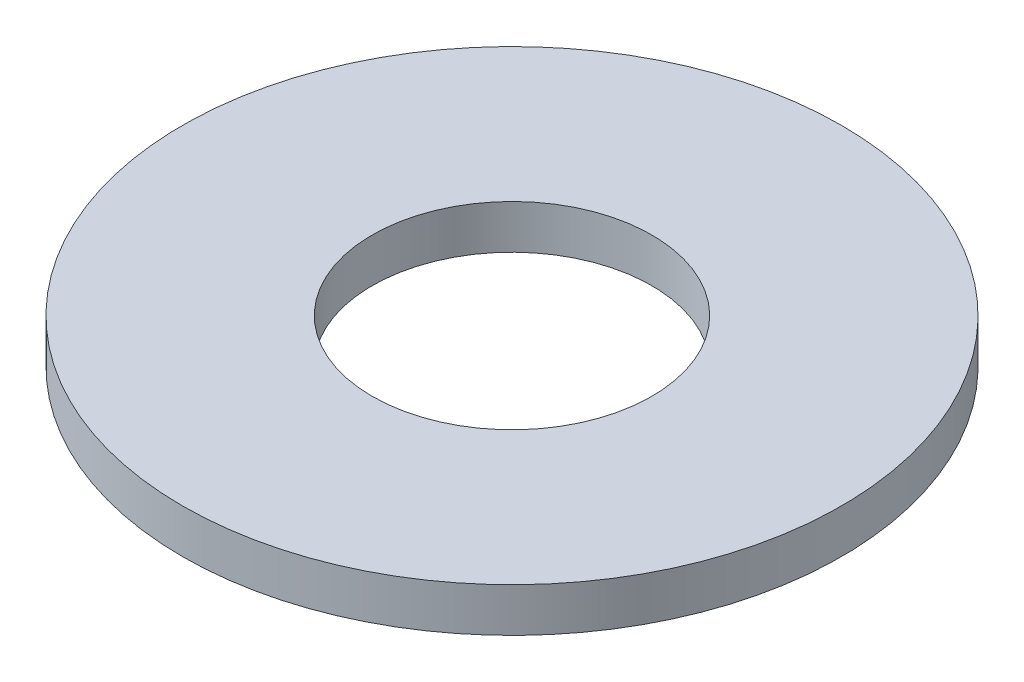
ISO-10303-21;
HEADER;
FILE_DESCRIPTION(('STEP AP214'),'2;1');
FILE_NAME('part.step','',(''),(''),'','','');
FILE_SCHEMA(('AUTOMOTIVE_DESIGN { 1 0 10303 214 1 1 1 1 }'));
ENDSEC;
DATA;
#1=APPLICATION_CONTEXT('core data for automotive mechanical design processes');
#2=APPLICATION_PROTOCOL_DEFINITION('international standard','automotive_design',2000,#1);
#3=PRODUCT_CONTEXT('',#1,'mechanical');
#4=PRODUCT('Part','Part','',(#3));
#5=PRODUCT_RELATED_PRODUCT_CATEGORY('part','',(#4));
#6=PRODUCT_DEFINITION_FORMATION('','',#4);
#7=PRODUCT_DEFINITION_CONTEXT('part definition',#1,'design');
#8=PRODUCT_DEFINITION('design','',#6,#7);
#9=PRODUCT_DEFINITION_SHAPE('','',#8);
#10=(LENGTH_UNIT() NAMED_UNIT(*) SI_UNIT(.MILLI.,.METRE.));
#11=(NAMED_UNIT(*) PLANE_ANGLE_UNIT() SI_UNIT($,.RADIAN.));
#12=(NAMED_UNIT(*) SI_UNIT($,.STERADIAN.) SOLID_ANGLE_UNIT());
#13=UNCERTAINTY_MEASURE_WITH_UNIT(LENGTH_MEASURE(1.E-05),#10,'distance_accuracy_value','');
#14=(GEOMETRIC_REPRESENTATION_CONTEXT(3) GLOBAL_UNCERTAINTY_ASSIGNED_CONTEXT((#13)) GLOBAL_UNIT_ASSIGNED_CONTEXT((#10,
#11,#12)) REPRESENTATION_CONTEXT('',''));
#15=CARTESIAN_POINT('',(0.,0.,0.));
#16=DIRECTION('',(0.,0.,1.));
#17=DIRECTION('',(1.,0.,0.));
#18=AXIS2_PLACEMENT_3D('',#15,#16,#17);
#19=CARTESIAN_POINT('',(0.,11.,0.));
#20=DIRECTION('',(0.,-1.,0.));
#21=DIRECTION('',(0.,0.,-1.));
#22=AXIS2_PLACEMENT_3D('',#19,#20,#21);
#23=CYLINDRICAL_SURFACE('',#22,82.5);
#24=CARTESIAN_POINT('',(0.,11.,0.));
#25=DIRECTION('',(0.,1.,0.));
#26=DIRECTION('',(0.,0.,1.));
#27=AXIS2_PLACEMENT_3D('',#24,#25,#26);
#28=CIRCLE('',#27,82.5);
#29=CARTESIAN_POINT('',(0.,11.,82.5));
#30=VERTEX_POINT('',#29);
#31=EDGE_CURVE('E10',#30,#30,#28,.T.);
#32=ORIENTED_EDGE('',*,*,#31,.F.);
#33=EDGE_LOOP('',(#32));
#34=FACE_BOUND('',#33,.T.);
#35=CARTESIAN_POINT('',(0.,0.,0.));
#36=DIRECTION('',(0.,1.,0.));
#37=DIRECTION('',(0.,0.,1.));
#38=AXIS2_PLACEMENT_3D('',#35,#36,#37);
#39=CIRCLE('',#38,82.5);
#40=CARTESIAN_POINT('',(0.,0.,82.5));
#41=VERTEX_POINT('',#40);
#42=EDGE_CURVE('E37',#41,#41,#39,.T.);
#43=ORIENTED_EDGE('',*,*,#42,.T.);
#44=EDGE_LOOP('',(#43));
#45=FACE_BOUND('',#44,.T.);
#46=ADVANCED_FACE('F40',(#34,#45),#23,.T.);
#47=CARTESIAN_POINT('',(0.,11.,0.));
#48=DIRECTION('',(0.,1.,0.));
#49=DIRECTION('',(0.,0.,1.));
#50=AXIS2_PLACEMENT_3D('',#47,#48,#49);
#51=PLANE('',#50);
#52=CARTESIAN_POINT('',(0.,11.,0.));
#53=DIRECTION('',(0.,1.,0.));
#54=DIRECTION('',(0.,0.,1.));
#55=AXIS2_PLACEMENT_3D('',#52,#53,#54);
#56=CIRCLE('',#55,35.);
#57=CARTESIAN_POINT('',(0.,11.,35.));
#58=VERTEX_POINT('',#57);
#59=EDGE_CURVE('E50',#58,#58,#56,.T.);
#60=ORIENTED_EDGE('',*,*,#59,.F.);
#61=EDGE_LOOP('',(#60));
#62=FACE_BOUND('',#61,.T.);
#63=ORIENTED_EDGE('',*,*,#31,.T.);
#64=EDGE_LOOP('',(#63));
#65=FACE_BOUND('',#64,.T.);
#66=ADVANCED_FACE('F59',(#62,#65),#51,.T.);
#67=CARTESIAN_POINT('',(0.,0.,0.));
#68=DIRECTION('',(0.,1.,0.));
#69=DIRECTION('',(0.,0.,1.));
#70=AXIS2_PLACEMENT_3D('',#67,#68,#69);
#71=PLANE('',#70);
#72=CARTESIAN_POINT('',(0.,0.,0.));
#73=DIRECTION('',(0.,1.,0.));
#74=DIRECTION('',(0.,0.,1.));
#75=AXIS2_PLACEMENT_3D('',#72,#73,#74);
#76=CIRCLE('',#75,35.);
#77=CARTESIAN_POINT('',(0.,0.,35.));
#78=VERTEX_POINT('',#77);
#79=EDGE_CURVE('E47',#78,#78,#76,.T.);
#80=ORIENTED_EDGE('',*,*,#79,.T.);
#81=EDGE_LOOP('',(#80));
#82=FACE_BOUND('',#81,.T.);
#83=ORIENTED_EDGE('',*,*,#42,.F.);
#84=EDGE_LOOP('',(#83));
#85=FACE_BOUND('',#84,.T.);
#86=ADVANCED_FACE('F58',(#82,#85),#71,.F.);
#87=CARTESIAN_POINT('',(0.,11.,0.));
#88=DIRECTION('',(0.,-1.,0.));
#89=DIRECTION('',(0.,0.,-1.));
#90=AXIS2_PLACEMENT_3D('',#87,#88,#89);
#91=CYLINDRICAL_SURFACE('',#90,35.);
#92=ORIENTED_EDGE('',*,*,#59,.T.);
#93=EDGE_LOOP('',(#92));
#94=FACE_BOUND('',#93,.T.);
#95=ORIENTED_EDGE('',*,*,#79,.F.);
#96=EDGE_LOOP('',(#95));
#97=FACE_BOUND('',#96,.T.);
#98=ADVANCED_FACE('F54',(#94,#97),#91,.F.);
#99=CLOSED_SHELL('',(#46,#66,#86,#98));
#100=MANIFOLD_SOLID_BREP('B2',#99);
#101=ADVANCED_BREP_SHAPE_REPRESENTATION('',(#18,#100),#14);
#102=SHAPE_DEFINITION_REPRESENTATION(#9,#101);
ENDSEC;
END-ISO-10303-21;
